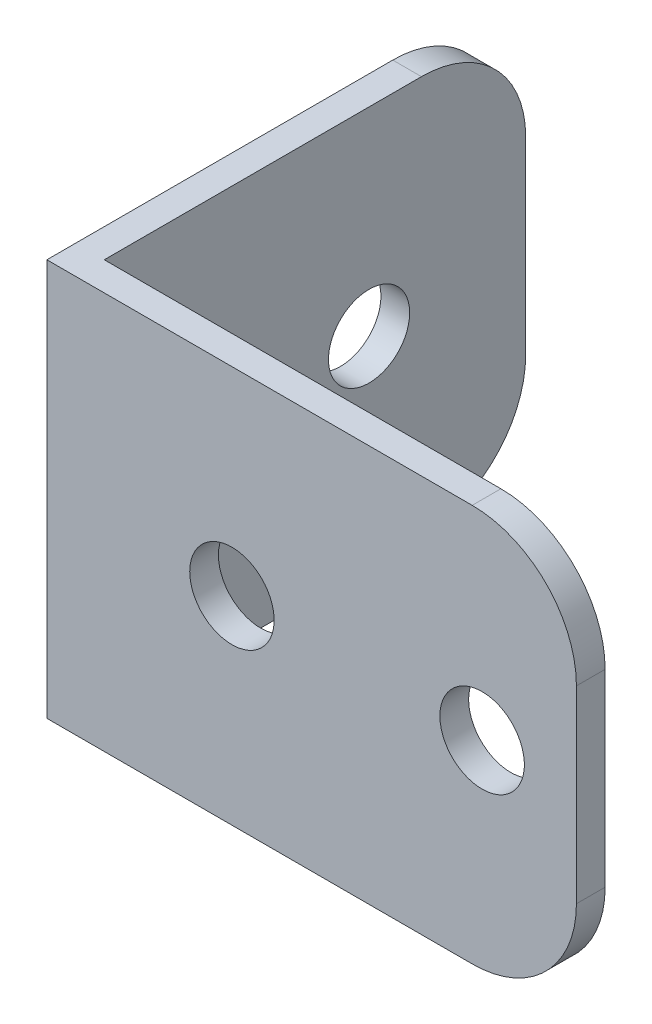
ISO-10303-21;
HEADER;
FILE_DESCRIPTION(('STEP AP214'),'2;1');
FILE_NAME('part.step','',(''),(''),'','','');
FILE_SCHEMA(('AUTOMOTIVE_DESIGN { 1 0 10303 214 1 1 1 1 }'));
ENDSEC;
DATA;
#1=APPLICATION_CONTEXT('core data for automotive mechanical design processes');
#2=APPLICATION_PROTOCOL_DEFINITION('international standard','automotive_design',2000,#1);
#3=PRODUCT_CONTEXT('',#1,'mechanical');
#4=PRODUCT('Part','Part','',(#3));
#5=PRODUCT_RELATED_PRODUCT_CATEGORY('part','',(#4));
#6=PRODUCT_DEFINITION_FORMATION('','',#4);
#7=PRODUCT_DEFINITION_CONTEXT('part definition',#1,'design');
#8=PRODUCT_DEFINITION('design','',#6,#7);
#9=PRODUCT_DEFINITION_SHAPE('','',#8);
#10=(LENGTH_UNIT() NAMED_UNIT(*) SI_UNIT(.MILLI.,.METRE.));
#11=(NAMED_UNIT(*) PLANE_ANGLE_UNIT() SI_UNIT($,.RADIAN.));
#12=(NAMED_UNIT(*) SI_UNIT($,.STERADIAN.) SOLID_ANGLE_UNIT());
#13=UNCERTAINTY_MEASURE_WITH_UNIT(LENGTH_MEASURE(1.E-05),#10,'distance_accuracy_value','');
#14=(GEOMETRIC_REPRESENTATION_CONTEXT(3) GLOBAL_UNCERTAINTY_ASSIGNED_CONTEXT((#13)) GLOBAL_UNIT_ASSIGNED_CONTEXT((#10,
#11,#12)) REPRESENTATION_CONTEXT('',''));
#15=CARTESIAN_POINT('',(0.,0.,0.));
#16=DIRECTION('',(0.,0.,1.));
#17=DIRECTION('',(1.,0.,0.));
#18=AXIS2_PLACEMENT_3D('',#15,#16,#17);
#19=CARTESIAN_POINT('',(-25.4,38.1,21.59));
#20=DIRECTION('',(1.,0.,0.));
#21=DIRECTION('',(0.,0.,-1.));
#22=AXIS2_PLACEMENT_3D('',#19,#20,#21);
#23=PLANE('',#22);
#24=CARTESIAN_POINT('',(-25.4,19.05,-6.56336));
#25=DIRECTION('',(1.,0.,0.));
#26=DIRECTION('',(0.,0.,-1.));
#27=AXIS2_PLACEMENT_3D('',#24,#25,#26);
#28=CIRCLE('',#27,3.89390758390676);
#29=CARTESIAN_POINT('',(-25.4,19.05,-10.4572675839068));
#30=VERTEX_POINT('',#29);
#31=EDGE_CURVE('E302',#30,#30,#28,.T.);
#32=ORIENTED_EDGE('',*,*,#31,.T.);
#33=EDGE_LOOP('',(#32));
#34=FACE_BOUND('',#33,.T.);
#35=DIRECTION('',(0.,0.,1.));
#36=VECTOR('',#35,1.);
#37=CARTESIAN_POINT('',(-25.4,38.1,21.59));
#38=LINE('',#37,#36);
#39=CARTESIAN_POINT('',(-25.4,38.1,-11.59));
#40=VERTEX_POINT('',#39);
#41=CARTESIAN_POINT('',(-25.4,38.1,21.59));
#42=VERTEX_POINT('',#41);
#43=EDGE_CURVE('E122',#40,#42,#38,.T.);
#44=ORIENTED_EDGE('',*,*,#43,.F.);
#45=CARTESIAN_POINT('',(-25.4,28.1,-11.59));
#46=DIRECTION('',(1.,0.,0.));
#47=DIRECTION('',(0.,0.,-1.));
#48=AXIS2_PLACEMENT_3D('',#45,#46,#47);
#49=CIRCLE('',#48,10.);
#50=CARTESIAN_POINT('',(-25.4,28.1,-21.59));
#51=VERTEX_POINT('',#50);
#52=EDGE_CURVE('E191',#40,#51,#49,.F.);
#53=ORIENTED_EDGE('',*,*,#52,.T.);
#54=DIRECTION('',(0.,-1.,0.));
#55=VECTOR('',#54,1.);
#56=CARTESIAN_POINT('',(-25.4,38.1,-21.59));
#57=LINE('',#56,#55);
#58=CARTESIAN_POINT('',(-25.4,10.,-21.59));
#59=VERTEX_POINT('',#58);
#60=EDGE_CURVE('E203',#51,#59,#57,.T.);
#61=ORIENTED_EDGE('',*,*,#60,.T.);
#62=CARTESIAN_POINT('',(-25.4,10.,-11.59));
#63=DIRECTION('',(1.,0.,0.));
#64=DIRECTION('',(0.,0.,-1.));
#65=AXIS2_PLACEMENT_3D('',#62,#63,#64);
#66=CIRCLE('',#65,10.);
#67=CARTESIAN_POINT('',(-25.4,0.,-11.59));
#68=VERTEX_POINT('',#67);
#69=EDGE_CURVE('E188',#59,#68,#66,.F.);
#70=ORIENTED_EDGE('',*,*,#69,.T.);
#71=DIRECTION('',(0.,0.,1.));
#72=VECTOR('',#71,1.);
#73=CARTESIAN_POINT('',(-25.4,0.,21.59));
#74=LINE('',#73,#72);
#75=CARTESIAN_POINT('',(-25.4,0.,21.59));
#76=VERTEX_POINT('',#75);
#77=EDGE_CURVE('E148',#68,#76,#74,.T.);
#78=ORIENTED_EDGE('',*,*,#77,.T.);
#79=DIRECTION('',(0.,-1.,0.));
#80=VECTOR('',#79,1.);
#81=CARTESIAN_POINT('',(-25.4,38.1,21.59));
#82=LINE('',#81,#80);
#83=EDGE_CURVE('E141',#42,#76,#82,.T.);
#84=ORIENTED_EDGE('',*,*,#83,.F.);
#85=EDGE_LOOP('',(#44,#53,#61,#70,#78,#84));
#86=FACE_BOUND('',#85,.T.);
#87=ADVANCED_FACE('F43',(#34,#86),#23,.F.);
#88=CARTESIAN_POINT('',(-25.4,38.1,21.59));
#89=DIRECTION('',(0.,0.,-1.));
#90=DIRECTION('',(-1.,0.,0.));
#91=AXIS2_PLACEMENT_3D('',#88,#89,#90);
#92=PLANE('',#91);
#93=CARTESIAN_POINT('',(16.35336,19.05,21.59));
#94=DIRECTION('',(0.,0.,-1.));
#95=DIRECTION('',(-1.,0.,0.));
#96=AXIS2_PLACEMENT_3D('',#93,#94,#95);
#97=CIRCLE('',#96,4.05);
#98=CARTESIAN_POINT('',(12.30336,19.05,21.59));
#99=VERTEX_POINT('',#98);
#100=EDGE_CURVE('E240',#99,#99,#97,.T.);
#101=ORIENTED_EDGE('',*,*,#100,.T.);
#102=EDGE_LOOP('',(#101));
#103=FACE_BOUND('',#102,.T.);
#104=CARTESIAN_POINT('',(-7.64663999999999,19.05,21.59));
#105=DIRECTION('',(0.,0.,-1.));
#106=DIRECTION('',(-1.,0.,0.));
#107=AXIS2_PLACEMENT_3D('',#104,#105,#106);
#108=CIRCLE('',#107,4.05);
#109=CARTESIAN_POINT('',(-11.69664,19.05,21.59));
#110=VERTEX_POINT('',#109);
#111=EDGE_CURVE('E309',#110,#110,#108,.T.);
#112=ORIENTED_EDGE('',*,*,#111,.T.);
#113=EDGE_LOOP('',(#112));
#114=FACE_BOUND('',#113,.T.);
#115=DIRECTION('',(0.,-1.,0.));
#116=VECTOR('',#115,1.);
#117=CARTESIAN_POINT('',(25.4,38.1,21.59));
#118=LINE('',#117,#116);
#119=CARTESIAN_POINT('',(25.4,28.1,21.59));
#120=VERTEX_POINT('',#119);
#121=CARTESIAN_POINT('',(25.4,10.,21.59));
#122=VERTEX_POINT('',#121);
#123=EDGE_CURVE('E151',#120,#122,#118,.T.);
#124=ORIENTED_EDGE('',*,*,#123,.F.);
#125=CARTESIAN_POINT('',(15.4,28.1,21.59));
#126=DIRECTION('',(0.,0.,-1.));
#127=DIRECTION('',(-1.,0.,0.));
#128=AXIS2_PLACEMENT_3D('',#125,#126,#127);
#129=CIRCLE('',#128,10.);
#130=CARTESIAN_POINT('',(15.4,38.1,21.59));
#131=VERTEX_POINT('',#130);
#132=EDGE_CURVE('E143',#120,#131,#129,.F.);
#133=ORIENTED_EDGE('',*,*,#132,.T.);
#134=DIRECTION('',(1.,0.,0.));
#135=VECTOR('',#134,1.);
#136=CARTESIAN_POINT('',(-25.4,38.1,21.59));
#137=LINE('',#136,#135);
#138=EDGE_CURVE('E126',#42,#131,#137,.T.);
#139=ORIENTED_EDGE('',*,*,#138,.F.);
#140=ORIENTED_EDGE('',*,*,#83,.T.);
#141=DIRECTION('',(1.,0.,0.));
#142=VECTOR('',#141,1.);
#143=CARTESIAN_POINT('',(-25.4,0.,21.59));
#144=LINE('',#143,#142);
#145=CARTESIAN_POINT('',(15.4,0.,21.59));
#146=VERTEX_POINT('',#145);
#147=EDGE_CURVE('E239',#76,#146,#144,.T.);
#148=ORIENTED_EDGE('',*,*,#147,.T.);
#149=CARTESIAN_POINT('',(15.4,10.,21.59));
#150=DIRECTION('',(0.,0.,-1.));
#151=DIRECTION('',(-1.,0.,0.));
#152=AXIS2_PLACEMENT_3D('',#149,#150,#151);
#153=CIRCLE('',#152,10.);
#154=EDGE_CURVE('E177',#146,#122,#153,.F.);
#155=ORIENTED_EDGE('',*,*,#154,.T.);
#156=EDGE_LOOP('',(#124,#133,#139,#140,#148,#155));
#157=FACE_BOUND('',#156,.T.);
#158=ADVANCED_FACE('F139',(#103,#114,#157),#92,.F.);
#159=CARTESIAN_POINT('',(25.4,38.1,21.59));
#160=DIRECTION('',(-1.,0.,0.));
#161=DIRECTION('',(0.,0.,1.));
#162=AXIS2_PLACEMENT_3D('',#159,#160,#161);
#163=PLANE('',#162);
#164=DIRECTION('',(0.,-1.,0.));
#165=VECTOR('',#164,1.);
#166=CARTESIAN_POINT('',(25.4,38.1,18.83664));
#167=LINE('',#166,#165);
#168=CARTESIAN_POINT('',(25.4,28.1,18.83664));
#169=VERTEX_POINT('',#168);
#170=CARTESIAN_POINT('',(25.4,10.,18.83664));
#171=VERTEX_POINT('',#170);
#172=EDGE_CURVE('E158',#169,#171,#167,.T.);
#173=ORIENTED_EDGE('',*,*,#172,.F.);
#174=DIRECTION('',(0.,0.,-1.));
#175=VECTOR('',#174,1.);
#176=CARTESIAN_POINT('',(25.4,28.1,21.59));
#177=LINE('',#176,#175);
#178=EDGE_CURVE('E174',#169,#120,#177,.F.);
#179=ORIENTED_EDGE('',*,*,#178,.T.);
#180=ORIENTED_EDGE('',*,*,#123,.T.);
#181=DIRECTION('',(0.,0.,-1.));
#182=VECTOR('',#181,1.);
#183=CARTESIAN_POINT('',(25.4,10.,18.83664));
#184=LINE('',#183,#182);
#185=EDGE_CURVE('E170',#122,#171,#184,.T.);
#186=ORIENTED_EDGE('',*,*,#185,.T.);
#187=EDGE_LOOP('',(#173,#179,#180,#186));
#188=FACE_BOUND('',#187,.T.);
#189=ADVANCED_FACE('F228',(#188),#163,.F.);
#190=CARTESIAN_POINT('',(25.4,38.1,18.83664));
#191=DIRECTION('',(0.,0.,1.));
#192=DIRECTION('',(1.,0.,0.));
#193=AXIS2_PLACEMENT_3D('',#190,#191,#192);
#194=PLANE('',#193);
#195=CARTESIAN_POINT('',(16.35336,19.05,18.83664));
#196=DIRECTION('',(0.,0.,-1.));
#197=DIRECTION('',(-1.,0.,0.));
#198=AXIS2_PLACEMENT_3D('',#195,#196,#197);
#199=CIRCLE('',#198,4.05);
#200=CARTESIAN_POINT('',(12.30336,19.05,18.83664));
#201=VERTEX_POINT('',#200);
#202=EDGE_CURVE('E315',#201,#201,#199,.T.);
#203=ORIENTED_EDGE('',*,*,#202,.F.);
#204=EDGE_LOOP('',(#203));
#205=FACE_BOUND('',#204,.T.);
#206=CARTESIAN_POINT('',(-7.64663999999999,19.05,18.83664));
#207=DIRECTION('',(0.,0.,-1.));
#208=DIRECTION('',(-1.,0.,0.));
#209=AXIS2_PLACEMENT_3D('',#206,#207,#208);
#210=CIRCLE('',#209,4.05);
#211=CARTESIAN_POINT('',(-11.69664,19.05,18.83664));
#212=VERTEX_POINT('',#211);
#213=EDGE_CURVE('E319',#212,#212,#210,.T.);
#214=ORIENTED_EDGE('',*,*,#213,.F.);
#215=EDGE_LOOP('',(#214));
#216=FACE_BOUND('',#215,.T.);
#217=DIRECTION('',(-1.,0.,0.));
#218=VECTOR('',#217,1.);
#219=CARTESIAN_POINT('',(25.4,38.1,18.83664));
#220=LINE('',#219,#218);
#221=CARTESIAN_POINT('',(15.4,38.1,18.83664));
#222=VERTEX_POINT('',#221);
#223=CARTESIAN_POINT('',(-22.64664,38.1,18.83664));
#224=VERTEX_POINT('',#223);
#225=EDGE_CURVE('E145',#222,#224,#220,.T.);
#226=ORIENTED_EDGE('',*,*,#225,.F.);
#227=CARTESIAN_POINT('',(15.4,28.1,18.83664));
#228=DIRECTION('',(0.,0.,1.));
#229=DIRECTION('',(1.,0.,0.));
#230=AXIS2_PLACEMENT_3D('',#227,#228,#229);
#231=CIRCLE('',#230,10.);
#232=EDGE_CURVE('E167',#222,#169,#231,.F.);
#233=ORIENTED_EDGE('',*,*,#232,.T.);
#234=ORIENTED_EDGE('',*,*,#172,.T.);
#235=CARTESIAN_POINT('',(15.4,10.,18.83664));
#236=DIRECTION('',(0.,0.,1.));
#237=DIRECTION('',(1.,0.,0.));
#238=AXIS2_PLACEMENT_3D('',#235,#236,#237);
#239=CIRCLE('',#238,10.);
#240=CARTESIAN_POINT('',(15.4,0.,18.83664));
#241=VERTEX_POINT('',#240);
#242=EDGE_CURVE('E164',#171,#241,#239,.F.);
#243=ORIENTED_EDGE('',*,*,#242,.T.);
#244=DIRECTION('',(-1.,0.,0.));
#245=VECTOR('',#244,1.);
#246=CARTESIAN_POINT('',(25.4,0.,18.83664));
#247=LINE('',#246,#245);
#248=CARTESIAN_POINT('',(-22.64664,0.,18.83664));
#249=VERTEX_POINT('',#248);
#250=EDGE_CURVE('E242',#241,#249,#247,.T.);
#251=ORIENTED_EDGE('',*,*,#250,.T.);
#252=DIRECTION('',(0.,-1.,0.));
#253=VECTOR('',#252,1.);
#254=CARTESIAN_POINT('',(-22.64664,38.1,18.83664));
#255=LINE('',#254,#253);
#256=EDGE_CURVE('E211',#224,#249,#255,.T.);
#257=ORIENTED_EDGE('',*,*,#256,.F.);
#258=EDGE_LOOP('',(#226,#233,#234,#243,#251,#257));
#259=FACE_BOUND('',#258,.T.);
#260=ADVANCED_FACE('F224',(#205,#216,#259),#194,.F.);
#261=CARTESIAN_POINT('',(-22.64664,38.1,-21.59));
#262=DIRECTION('',(-1.,0.,0.));
#263=DIRECTION('',(0.,0.,1.));
#264=AXIS2_PLACEMENT_3D('',#261,#262,#263);
#265=PLANE('',#264);
#266=CARTESIAN_POINT('',(-22.64664,19.05,-6.56336));
#267=DIRECTION('',(1.,0.,0.));
#268=DIRECTION('',(0.,0.,-1.));
#269=AXIS2_PLACEMENT_3D('',#266,#267,#268);
#270=CIRCLE('',#269,3.89390758390676);
#271=CARTESIAN_POINT('',(-22.64664,19.05,-10.4572675839068));
#272=VERTEX_POINT('',#271);
#273=EDGE_CURVE('E305',#272,#272,#270,.T.);
#274=ORIENTED_EDGE('',*,*,#273,.F.);
#275=EDGE_LOOP('',(#274));
#276=FACE_BOUND('',#275,.T.);
#277=DIRECTION('',(0.,-1.,0.));
#278=VECTOR('',#277,1.);
#279=CARTESIAN_POINT('',(-22.64664,38.1,-21.59));
#280=LINE('',#279,#278);
#281=CARTESIAN_POINT('',(-22.64664,28.1,-21.59));
#282=VERTEX_POINT('',#281);
#283=CARTESIAN_POINT('',(-22.64664,10.,-21.59));
#284=VERTEX_POINT('',#283);
#285=EDGE_CURVE('E204',#282,#284,#280,.T.);
#286=ORIENTED_EDGE('',*,*,#285,.F.);
#287=CARTESIAN_POINT('',(-22.64664,28.1,-11.59));
#288=DIRECTION('',(-1.,0.,0.));
#289=DIRECTION('',(0.,0.,1.));
#290=AXIS2_PLACEMENT_3D('',#287,#288,#289);
#291=CIRCLE('',#290,10.);
#292=CARTESIAN_POINT('',(-22.64664,38.1,-11.59));
#293=VERTEX_POINT('',#292);
#294=EDGE_CURVE('E11',#282,#293,#291,.F.);
#295=ORIENTED_EDGE('',*,*,#294,.T.);
#296=DIRECTION('',(0.,0.,-1.));
#297=VECTOR('',#296,1.);
#298=CARTESIAN_POINT('',(-22.64664,38.1,-21.59));
#299=LINE('',#298,#297);
#300=EDGE_CURVE('E207',#224,#293,#299,.T.);
#301=ORIENTED_EDGE('',*,*,#300,.F.);
#302=ORIENTED_EDGE('',*,*,#256,.T.);
#303=DIRECTION('',(0.,0.,-1.));
#304=VECTOR('',#303,1.);
#305=CARTESIAN_POINT('',(-22.64664,0.,-21.59));
#306=LINE('',#305,#304);
#307=CARTESIAN_POINT('',(-22.64664,0.,-11.59));
#308=VERTEX_POINT('',#307);
#309=EDGE_CURVE('E134',#249,#308,#306,.T.);
#310=ORIENTED_EDGE('',*,*,#309,.T.);
#311=CARTESIAN_POINT('',(-22.64664,10.,-11.59));
#312=DIRECTION('',(-1.,0.,0.));
#313=DIRECTION('',(0.,0.,1.));
#314=AXIS2_PLACEMENT_3D('',#311,#312,#313);
#315=CIRCLE('',#314,10.);
#316=EDGE_CURVE('E52',#308,#284,#315,.F.);
#317=ORIENTED_EDGE('',*,*,#316,.T.);
#318=EDGE_LOOP('',(#286,#295,#301,#302,#310,#317));
#319=FACE_BOUND('',#318,.T.);
#320=ADVANCED_FACE('F246',(#276,#319),#265,.F.);
#321=CARTESIAN_POINT('',(-25.4,38.1,-21.59));
#322=DIRECTION('',(0.,0.,1.));
#323=DIRECTION('',(1.,0.,0.));
#324=AXIS2_PLACEMENT_3D('',#321,#322,#323);
#325=PLANE('',#324);
#326=ORIENTED_EDGE('',*,*,#60,.F.);
#327=DIRECTION('',(-1.,0.,0.));
#328=VECTOR('',#327,1.);
#329=CARTESIAN_POINT('',(-25.4,28.1,-21.59));
#330=LINE('',#329,#328);
#331=EDGE_CURVE('E65',#51,#282,#330,.F.);
#332=ORIENTED_EDGE('',*,*,#331,.T.);
#333=ORIENTED_EDGE('',*,*,#285,.T.);
#334=DIRECTION('',(-1.,0.,0.));
#335=VECTOR('',#334,1.);
#336=CARTESIAN_POINT('',(-25.4,10.,-21.59));
#337=LINE('',#336,#335);
#338=EDGE_CURVE('E194',#284,#59,#337,.T.);
#339=ORIENTED_EDGE('',*,*,#338,.T.);
#340=EDGE_LOOP('',(#326,#332,#333,#339));
#341=FACE_BOUND('',#340,.T.);
#342=ADVANCED_FACE('F202',(#341),#325,.F.);
#343=CARTESIAN_POINT('',(0.,38.1,0.));
#344=DIRECTION('',(0.,-1.,0.));
#345=DIRECTION('',(0.,0.,-1.));
#346=AXIS2_PLACEMENT_3D('',#343,#344,#345);
#347=PLANE('',#346);
#348=ORIENTED_EDGE('',*,*,#138,.T.);
#349=DIRECTION('',(0.,0.,-1.));
#350=VECTOR('',#349,1.);
#351=CARTESIAN_POINT('',(15.4,38.1,0.));
#352=LINE('',#351,#350);
#353=EDGE_CURVE('E155',#131,#222,#352,.T.);
#354=ORIENTED_EDGE('',*,*,#353,.T.);
#355=ORIENTED_EDGE('',*,*,#225,.T.);
#356=ORIENTED_EDGE('',*,*,#300,.T.);
#357=DIRECTION('',(-1.,0.,0.));
#358=VECTOR('',#357,1.);
#359=CARTESIAN_POINT('',(0.,38.1,-11.59));
#360=LINE('',#359,#358);
#361=EDGE_CURVE('E130',#293,#40,#360,.T.);
#362=ORIENTED_EDGE('',*,*,#361,.T.);
#363=ORIENTED_EDGE('',*,*,#43,.T.);
#364=EDGE_LOOP('',(#348,#354,#355,#356,#362,#363));
#365=FACE_BOUND('',#364,.T.);
#366=ADVANCED_FACE('F124',(#365),#347,.F.);
#367=CARTESIAN_POINT('',(0.,0.,0.));
#368=DIRECTION('',(0.,-1.,0.));
#369=DIRECTION('',(0.,0.,-1.));
#370=AXIS2_PLACEMENT_3D('',#367,#368,#369);
#371=PLANE('',#370);
#372=ORIENTED_EDGE('',*,*,#250,.F.);
#373=DIRECTION('',(0.,0.,-1.));
#374=VECTOR('',#373,1.);
#375=CARTESIAN_POINT('',(15.4,0.,21.59));
#376=LINE('',#375,#374);
#377=EDGE_CURVE('E185',#241,#146,#376,.F.);
#378=ORIENTED_EDGE('',*,*,#377,.T.);
#379=ORIENTED_EDGE('',*,*,#147,.F.);
#380=ORIENTED_EDGE('',*,*,#77,.F.);
#381=DIRECTION('',(-1.,0.,0.));
#382=VECTOR('',#381,1.);
#383=CARTESIAN_POINT('',(-22.64664,0.,-11.59));
#384=LINE('',#383,#382);
#385=EDGE_CURVE('E182',#68,#308,#384,.F.);
#386=ORIENTED_EDGE('',*,*,#385,.T.);
#387=ORIENTED_EDGE('',*,*,#309,.F.);
#388=EDGE_LOOP('',(#372,#378,#379,#380,#386,#387));
#389=FACE_BOUND('',#388,.T.);
#390=ADVANCED_FACE('F249',(#389),#371,.T.);
#391=CARTESIAN_POINT('',(15.4,28.1,0.));
#392=DIRECTION('',(0.,0.,-1.));
#393=DIRECTION('',(-1.,0.,0.));
#394=AXIS2_PLACEMENT_3D('',#391,#392,#393);
#395=CYLINDRICAL_SURFACE('',#394,10.);
#396=ORIENTED_EDGE('',*,*,#132,.F.);
#397=ORIENTED_EDGE('',*,*,#178,.F.);
#398=ORIENTED_EDGE('',*,*,#232,.F.);
#399=ORIENTED_EDGE('',*,*,#353,.F.);
#400=EDGE_LOOP('',(#396,#397,#398,#399));
#401=FACE_BOUND('',#400,.T.);
#402=ADVANCED_FACE('F231',(#401),#395,.T.);
#403=CARTESIAN_POINT('',(15.4,10.,21.59));
#404=DIRECTION('',(0.,0.,1.));
#405=DIRECTION('',(1.,0.,0.));
#406=AXIS2_PLACEMENT_3D('',#403,#404,#405);
#407=CYLINDRICAL_SURFACE('',#406,10.);
#408=ORIENTED_EDGE('',*,*,#154,.F.);
#409=ORIENTED_EDGE('',*,*,#377,.F.);
#410=ORIENTED_EDGE('',*,*,#242,.F.);
#411=ORIENTED_EDGE('',*,*,#185,.F.);
#412=EDGE_LOOP('',(#408,#409,#410,#411));
#413=FACE_BOUND('',#412,.T.);
#414=ADVANCED_FACE('F253',(#413),#407,.T.);
#415=CARTESIAN_POINT('',(0.,28.1,-11.59));
#416=DIRECTION('',(-1.,0.,0.));
#417=DIRECTION('',(0.,0.,1.));
#418=AXIS2_PLACEMENT_3D('',#415,#416,#417);
#419=CYLINDRICAL_SURFACE('',#418,10.);
#420=ORIENTED_EDGE('',*,*,#294,.F.);
#421=ORIENTED_EDGE('',*,*,#331,.F.);
#422=ORIENTED_EDGE('',*,*,#52,.F.);
#423=ORIENTED_EDGE('',*,*,#361,.F.);
#424=EDGE_LOOP('',(#420,#421,#422,#423));
#425=FACE_BOUND('',#424,.T.);
#426=ADVANCED_FACE('F255',(#425),#419,.T.);
#427=CARTESIAN_POINT('',(-25.4,10.,-11.59));
#428=DIRECTION('',(1.,0.,0.));
#429=DIRECTION('',(0.,0.,-1.));
#430=AXIS2_PLACEMENT_3D('',#427,#428,#429);
#431=CYLINDRICAL_SURFACE('',#430,10.);
#432=ORIENTED_EDGE('',*,*,#316,.F.);
#433=ORIENTED_EDGE('',*,*,#385,.F.);
#434=ORIENTED_EDGE('',*,*,#69,.F.);
#435=ORIENTED_EDGE('',*,*,#338,.F.);
#436=EDGE_LOOP('',(#432,#433,#434,#435));
#437=FACE_BOUND('',#436,.T.);
#438=ADVANCED_FACE('F45',(#437),#431,.T.);
#439=CARTESIAN_POINT('',(-7.64663999999999,19.05,21.59));
#440=DIRECTION('',(0.,0.,-1.));
#441=DIRECTION('',(-1.,0.,0.));
#442=AXIS2_PLACEMENT_3D('',#439,#440,#441);
#443=CYLINDRICAL_SURFACE('',#442,4.05);
#444=ORIENTED_EDGE('',*,*,#111,.F.);
#445=EDGE_LOOP('',(#444));
#446=FACE_BOUND('',#445,.T.);
#447=ORIENTED_EDGE('',*,*,#213,.T.);
#448=EDGE_LOOP('',(#447));
#449=FACE_BOUND('',#448,.T.);
#450=ADVANCED_FACE('F287',(#446,#449),#443,.F.);
#451=CARTESIAN_POINT('',(16.35336,19.05,21.59));
#452=DIRECTION('',(0.,0.,-1.));
#453=DIRECTION('',(-1.,0.,0.));
#454=AXIS2_PLACEMENT_3D('',#451,#452,#453);
#455=CYLINDRICAL_SURFACE('',#454,4.05);
#456=ORIENTED_EDGE('',*,*,#100,.F.);
#457=EDGE_LOOP('',(#456));
#458=FACE_BOUND('',#457,.T.);
#459=ORIENTED_EDGE('',*,*,#202,.T.);
#460=EDGE_LOOP('',(#459));
#461=FACE_BOUND('',#460,.T.);
#462=ADVANCED_FACE('F290',(#458,#461),#455,.F.);
#463=CARTESIAN_POINT('',(-25.4,19.05,-6.56336));
#464=DIRECTION('',(1.,0.,0.));
#465=DIRECTION('',(0.,0.,-1.));
#466=AXIS2_PLACEMENT_3D('',#463,#464,#465);
#467=CYLINDRICAL_SURFACE('',#466,3.89390758390676);
#468=ORIENTED_EDGE('',*,*,#31,.F.);
#469=EDGE_LOOP('',(#468));
#470=FACE_BOUND('',#469,.T.);
#471=ORIENTED_EDGE('',*,*,#273,.T.);
#472=EDGE_LOOP('',(#471));
#473=FACE_BOUND('',#472,.T.);
#474=ADVANCED_FACE('F294',(#470,#473),#467,.F.);
#475=CLOSED_SHELL('',(#87,#158,#189,#260,#320,#342,#366,#390,#402,#414,#426,#438,#450,#462,#474));
#476=MANIFOLD_SOLID_BREP('B2',#475);
#477=ADVANCED_BREP_SHAPE_REPRESENTATION('',(#18,#476),#14);
#478=SHAPE_DEFINITION_REPRESENTATION(#9,#477);
ENDSEC;
END-ISO-10303-21;
